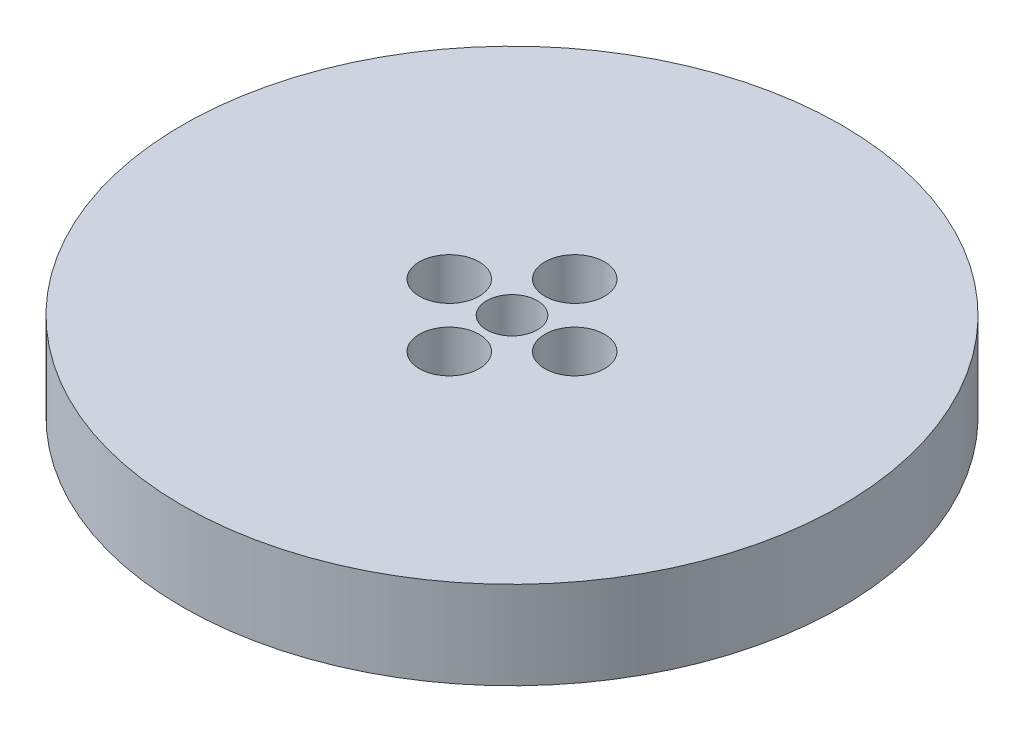
ISO-10303-21;
HEADER;
FILE_DESCRIPTION(('STEP AP214'),'2;1');
FILE_NAME('part.step','',(''),(''),'','','');
FILE_SCHEMA(('AUTOMOTIVE_DESIGN { 1 0 10303 214 1 1 1 1 }'));
ENDSEC;
DATA;
#1=APPLICATION_CONTEXT('core data for automotive mechanical design processes');
#2=APPLICATION_PROTOCOL_DEFINITION('international standard','automotive_design',2000,#1);
#3=PRODUCT_CONTEXT('',#1,'mechanical');
#4=PRODUCT('Part','Part','',(#3));
#5=PRODUCT_RELATED_PRODUCT_CATEGORY('part','',(#4));
#6=PRODUCT_DEFINITION_FORMATION('','',#4);
#7=PRODUCT_DEFINITION_CONTEXT('part definition',#1,'design');
#8=PRODUCT_DEFINITION('design','',#6,#7);
#9=PRODUCT_DEFINITION_SHAPE('','',#8);
#10=(LENGTH_UNIT() NAMED_UNIT(*) SI_UNIT(.MILLI.,.METRE.));
#11=(NAMED_UNIT(*) PLANE_ANGLE_UNIT() SI_UNIT($,.RADIAN.));
#12=(NAMED_UNIT(*) SI_UNIT($,.STERADIAN.) SOLID_ANGLE_UNIT());
#13=UNCERTAINTY_MEASURE_WITH_UNIT(LENGTH_MEASURE(1.E-05),#10,'distance_accuracy_value','');
#14=(GEOMETRIC_REPRESENTATION_CONTEXT(3) GLOBAL_UNCERTAINTY_ASSIGNED_CONTEXT((#13)) GLOBAL_UNIT_ASSIGNED_CONTEXT((#10,
#11,#12)) REPRESENTATION_CONTEXT('',''));
#15=CARTESIAN_POINT('',(0.,0.,0.));
#16=DIRECTION('',(0.,0.,1.));
#17=DIRECTION('',(1.,0.,0.));
#18=AXIS2_PLACEMENT_3D('',#15,#16,#17);
#19=CARTESIAN_POINT('',(0.,26.,0.));
#20=DIRECTION('',(0.,-1.,0.));
#21=DIRECTION('',(0.,0.,-1.));
#22=AXIS2_PLACEMENT_3D('',#19,#20,#21);
#23=CYLINDRICAL_SURFACE('',#22,97.5);
#24=CARTESIAN_POINT('',(0.,26.,0.));
#25=DIRECTION('',(0.,1.,0.));
#26=DIRECTION('',(0.,0.,1.));
#27=AXIS2_PLACEMENT_3D('',#24,#25,#26);
#28=CIRCLE('',#27,97.5);
#29=CARTESIAN_POINT('',(0.,26.,-97.5));
#30=VERTEX_POINT('',#29);
#31=EDGE_CURVE('E10',#30,#30,#28,.T.);
#32=CARTESIAN_POINT('',(0.,0.,0.));
#33=DIRECTION('',(0.,1.,0.));
#34=DIRECTION('',(0.,0.,1.));
#35=AXIS2_PLACEMENT_3D('',#32,#33,#34);
#36=CIRCLE('',#35,97.5);
#37=CARTESIAN_POINT('',(0.,0.,-97.5));
#38=VERTEX_POINT('',#37);
#39=EDGE_CURVE('E37',#38,#38,#36,.T.);
#40=CARTESIAN_POINT('',(0.,26.,-97.5));
#41=CARTESIAN_POINT('',(0.,25.7291666666667,-97.5));
#42=CARTESIAN_POINT('',(0.,25.4583333333333,-97.5));
#43=CARTESIAN_POINT('',(0.,24.9166666666667,-97.5));
#44=CARTESIAN_POINT('',(0.,24.6458333333333,-97.5));
#45=CARTESIAN_POINT('',(0.,24.1041666666667,-97.5));
#46=CARTESIAN_POINT('',(0.,23.8333333333333,-97.5));
#47=CARTESIAN_POINT('',(0.,23.2916666666667,-97.5));
#48=CARTESIAN_POINT('',(0.,23.0208333333333,-97.5));
#49=CARTESIAN_POINT('',(0.,22.4791666666667,-97.5));
#50=CARTESIAN_POINT('',(0.,22.2083333333333,-97.5));
#51=CARTESIAN_POINT('',(0.,21.6666666666667,-97.5));
#52=CARTESIAN_POINT('',(0.,21.3958333333333,-97.5));
#53=CARTESIAN_POINT('',(0.,20.8541666666667,-97.5));
#54=CARTESIAN_POINT('',(0.,20.5833333333333,-97.5));
#55=CARTESIAN_POINT('',(0.,20.0416666666667,-97.5));
#56=CARTESIAN_POINT('',(0.,19.7708333333333,-97.5));
#57=CARTESIAN_POINT('',(0.,19.2291666666667,-97.5));
#58=CARTESIAN_POINT('',(0.,18.9583333333333,-97.5));
#59=CARTESIAN_POINT('',(0.,18.4166666666667,-97.5));
#60=CARTESIAN_POINT('',(0.,18.1458333333333,-97.5));
#61=CARTESIAN_POINT('',(0.,17.6041666666667,-97.5));
#62=CARTESIAN_POINT('',(0.,17.3333333333333,-97.5));
#63=CARTESIAN_POINT('',(0.,16.7916666666667,-97.5));
#64=CARTESIAN_POINT('',(0.,16.5208333333333,-97.5));
#65=CARTESIAN_POINT('',(0.,15.9791666666667,-97.5));
#66=CARTESIAN_POINT('',(0.,15.7083333333333,-97.5));
#67=CARTESIAN_POINT('',(0.,15.1666666666667,-97.5));
#68=CARTESIAN_POINT('',(0.,14.8958333333333,-97.5));
#69=CARTESIAN_POINT('',(0.,14.3541666666667,-97.5));
#70=CARTESIAN_POINT('',(0.,14.0833333333333,-97.5));
#71=CARTESIAN_POINT('',(0.,13.5416666666667,-97.5));
#72=CARTESIAN_POINT('',(0.,13.2708333333333,-97.5));
#73=CARTESIAN_POINT('',(0.,12.7291666666667,-97.5));
#74=CARTESIAN_POINT('',(0.,12.4583333333333,-97.5));
#75=CARTESIAN_POINT('',(0.,11.9166666666667,-97.5));
#76=CARTESIAN_POINT('',(0.,11.6458333333333,-97.5));
#77=CARTESIAN_POINT('',(0.,11.1041666666667,-97.5));
#78=CARTESIAN_POINT('',(0.,10.8333333333333,-97.5));
#79=CARTESIAN_POINT('',(0.,10.2916666666667,-97.5));
#80=CARTESIAN_POINT('',(0.,10.0208333333333,-97.5));
#81=CARTESIAN_POINT('',(0.,9.47916666666667,-97.5));
#82=CARTESIAN_POINT('',(0.,9.20833333333333,-97.5));
#83=CARTESIAN_POINT('',(0.,8.66666666666667,-97.5));
#84=CARTESIAN_POINT('',(0.,8.39583333333333,-97.5));
#85=CARTESIAN_POINT('',(0.,7.85416666666667,-97.5));
#86=CARTESIAN_POINT('',(0.,7.58333333333333,-97.5));
#87=CARTESIAN_POINT('',(0.,7.04166666666667,-97.5));
#88=CARTESIAN_POINT('',(0.,6.77083333333333,-97.5));
#89=CARTESIAN_POINT('',(0.,6.22916666666667,-97.5));
#90=CARTESIAN_POINT('',(0.,5.95833333333333,-97.5));
#91=CARTESIAN_POINT('',(0.,5.41666666666667,-97.5));
#92=CARTESIAN_POINT('',(0.,5.14583333333333,-97.5));
#93=CARTESIAN_POINT('',(0.,4.60416666666667,-97.5));
#94=CARTESIAN_POINT('',(0.,4.33333333333333,-97.5));
#95=CARTESIAN_POINT('',(0.,3.79166666666667,-97.5));
#96=CARTESIAN_POINT('',(0.,3.52083333333333,-97.5));
#97=CARTESIAN_POINT('',(0.,2.97916666666667,-97.5));
#98=CARTESIAN_POINT('',(0.,2.70833333333333,-97.5));
#99=CARTESIAN_POINT('',(0.,2.16666666666667,-97.5));
#100=CARTESIAN_POINT('',(0.,1.89583333333333,-97.5));
#101=CARTESIAN_POINT('',(0.,1.35416666666667,-97.5));
#102=CARTESIAN_POINT('',(0.,1.08333333333333,-97.5));
#103=CARTESIAN_POINT('',(0.,0.541666666666667,-97.5));
#104=CARTESIAN_POINT('',(0.,0.270833333333334,-97.5));
#105=CARTESIAN_POINT('',(0.,0.,-97.5));
#106=B_SPLINE_CURVE_WITH_KNOTS('',3,(#40,#41,#42,#43,#44,#45,#46,#47,#48,#49,#50,#51,#52,#53,
#54,#55,#56,#57,#58,#59,#60,#61,#62,#63,#64,#65,#66,#67,#68,#69,#70,#71,#72,#73,#74,#75,#76,#77,
#78,#79,#80,#81,#82,#83,#84,#85,#86,#87,#88,#89,#90,#91,#92,#93,#94,#95,#96,#97,#98,#99,#100,
#101,#102,#103,#104,#105),.UNSPECIFIED.,.F.,.F.,(4,2,2,2,2,2,2,2,2,2,2,2,2,2,2,2,2,2,2,2,2,2,2,
2,2,2,2,2,2,2,2,2,4),(0.,0.812500000000001,1.625,2.4375,3.25,4.0625,4.875,5.6875,6.5,7.3125,
8.125,8.9375,9.75,10.5625,11.375,12.1875,13.,13.8125,14.625,15.4375,16.25,17.0625,17.875,
18.6875,19.5,20.3125,21.125,21.9375,22.75,23.5625,24.375,25.1875,26.),.UNSPECIFIED.);
#107=EDGE_CURVE('BSEAM40',#30,#38,#106,.T.);
#108=ORIENTED_EDGE('',*,*,#31,.F.);
#109=ORIENTED_EDGE('',*,*,#39,.T.);
#110=ORIENTED_EDGE('',*,*,#107,.T.);
#111=ORIENTED_EDGE('',*,*,#107,.F.);
#112=EDGE_LOOP('',(#108,#110,#109,#111));
#113=FACE_BOUND('',#112,.T.);
#114=ADVANCED_FACE('F40',(#113),#23,.T.);
#115=CARTESIAN_POINT('',(0.,26.,0.));
#116=DIRECTION('',(0.,1.,0.));
#117=DIRECTION('',(0.,0.,1.));
#118=AXIS2_PLACEMENT_3D('',#115,#116,#117);
#119=PLANE('',#118);
#120=CARTESIAN_POINT('',(0.,26.,18.5635144702194));
#121=DIRECTION('',(0.,1.,0.));
#122=DIRECTION('',(1.,0.,0.));
#123=AXIS2_PLACEMENT_3D('',#120,#121,#122);
#124=CIRCLE('',#123,8.83991167098881);
#125=CARTESIAN_POINT('',(8.83991167098888,26.,18.5635144702193));
#126=VERTEX_POINT('',#125);
#127=EDGE_CURVE('E71',#126,#126,#124,.T.);
#128=ORIENTED_EDGE('',*,*,#127,.F.);
#129=EDGE_LOOP('',(#128));
#130=FACE_BOUND('',#129,.T.);
#131=CARTESIAN_POINT('',(18.5635144702194,26.,0.));
#132=DIRECTION('',(0.,1.,0.));
#133=DIRECTION('',(0.,0.,-1.));
#134=AXIS2_PLACEMENT_3D('',#131,#132,#133);
#135=CIRCLE('',#134,8.83991167098881);
#136=CARTESIAN_POINT('',(18.5635144702194,26.,-8.83991167098881));
#137=VERTEX_POINT('',#136);
#138=EDGE_CURVE('E70',#137,#137,#135,.T.);
#139=ORIENTED_EDGE('',*,*,#138,.F.);
#140=EDGE_LOOP('',(#139));
#141=FACE_BOUND('',#140,.T.);
#142=CARTESIAN_POINT('',(-1.94442493068346E-13,26.,-18.5635144702194));
#143=DIRECTION('',(0.,1.,0.));
#144=DIRECTION('',(-1.,0.,0.));
#145=AXIS2_PLACEMENT_3D('',#142,#143,#144);
#146=CIRCLE('',#145,8.83991167098881);
#147=CARTESIAN_POINT('',(-8.83991167098901,26.,-18.5635144702193));
#148=VERTEX_POINT('',#147);
#149=EDGE_CURVE('E61',#148,#148,#146,.T.);
#150=ORIENTED_EDGE('',*,*,#149,.F.);
#151=EDGE_LOOP('',(#150));
#152=FACE_BOUND('',#151,.T.);
#153=CARTESIAN_POINT('',(-18.5635144702194,26.,0.));
#154=DIRECTION('',(0.,1.,0.));
#155=DIRECTION('',(0.,0.,1.));
#156=AXIS2_PLACEMENT_3D('',#153,#154,#155);
#157=CIRCLE('',#156,8.83991167098881);
#158=CARTESIAN_POINT('',(-18.5635144702194,26.,8.83991167098881));
#159=VERTEX_POINT('',#158);
#160=EDGE_CURVE('E54',#159,#159,#157,.T.);
#161=ORIENTED_EDGE('',*,*,#160,.F.);
#162=EDGE_LOOP('',(#161));
#163=FACE_BOUND('',#162,.T.);
#164=CARTESIAN_POINT('',(0.,26.,0.));
#165=DIRECTION('',(0.,1.,0.));
#166=DIRECTION('',(0.,0.,1.));
#167=AXIS2_PLACEMENT_3D('',#164,#165,#166);
#168=CIRCLE('',#167,7.5);
#169=CARTESIAN_POINT('',(0.,26.,-7.5));
#170=VERTEX_POINT('',#169);
#171=EDGE_CURVE('E50',#170,#170,#168,.T.);
#172=ORIENTED_EDGE('',*,*,#171,.F.);
#173=EDGE_LOOP('',(#172));
#174=FACE_BOUND('',#173,.T.);
#175=ORIENTED_EDGE('',*,*,#31,.T.);
#176=EDGE_LOOP('',(#175));
#177=FACE_BOUND('',#176,.T.);
#178=ADVANCED_FACE('F86',(#130,#141,#152,#163,#174,#177),#119,.T.);
#179=CARTESIAN_POINT('',(0.,0.,0.));
#180=DIRECTION('',(0.,1.,0.));
#181=DIRECTION('',(0.,0.,1.));
#182=AXIS2_PLACEMENT_3D('',#179,#180,#181);
#183=PLANE('',#182);
#184=CARTESIAN_POINT('',(0.,0.,0.));
#185=DIRECTION('',(0.,1.,0.));
#186=DIRECTION('',(0.,0.,1.));
#187=AXIS2_PLACEMENT_3D('',#184,#185,#186);
#188=CIRCLE('',#187,7.5);
#189=CARTESIAN_POINT('',(0.,0.,-7.5));
#190=VERTEX_POINT('',#189);
#191=EDGE_CURVE('E47',#190,#190,#188,.T.);
#192=ORIENTED_EDGE('',*,*,#191,.T.);
#193=EDGE_LOOP('',(#192));
#194=FACE_BOUND('',#193,.T.);
#195=ORIENTED_EDGE('',*,*,#39,.F.);
#196=EDGE_LOOP('',(#195));
#197=FACE_BOUND('',#196,.T.);
#198=ADVANCED_FACE('F93',(#194,#197),#183,.F.);
#199=CARTESIAN_POINT('',(0.,26.,0.));
#200=DIRECTION('',(0.,-1.,0.));
#201=DIRECTION('',(0.,0.,-1.));
#202=AXIS2_PLACEMENT_3D('',#199,#200,#201);
#203=CYLINDRICAL_SURFACE('',#202,7.5);
#204=CARTESIAN_POINT('',(0.,26.,-7.5));
#205=CARTESIAN_POINT('',(0.,25.7291666666667,-7.5));
#206=CARTESIAN_POINT('',(0.,25.4583333333333,-7.5));
#207=CARTESIAN_POINT('',(0.,24.9166666666667,-7.5));
#208=CARTESIAN_POINT('',(0.,24.6458333333333,-7.5));
#209=CARTESIAN_POINT('',(0.,24.1041666666667,-7.5));
#210=CARTESIAN_POINT('',(0.,23.8333333333333,-7.5));
#211=CARTESIAN_POINT('',(0.,23.2916666666667,-7.5));
#212=CARTESIAN_POINT('',(0.,23.0208333333333,-7.5));
#213=CARTESIAN_POINT('',(0.,22.4791666666667,-7.5));
#214=CARTESIAN_POINT('',(0.,22.2083333333333,-7.5));
#215=CARTESIAN_POINT('',(0.,21.6666666666667,-7.5));
#216=CARTESIAN_POINT('',(0.,21.3958333333333,-7.5));
#217=CARTESIAN_POINT('',(0.,20.8541666666667,-7.5));
#218=CARTESIAN_POINT('',(0.,20.5833333333333,-7.5));
#219=CARTESIAN_POINT('',(0.,20.0416666666667,-7.5));
#220=CARTESIAN_POINT('',(0.,19.7708333333333,-7.5));
#221=CARTESIAN_POINT('',(0.,19.2291666666667,-7.5));
#222=CARTESIAN_POINT('',(0.,18.9583333333333,-7.5));
#223=CARTESIAN_POINT('',(0.,18.4166666666667,-7.5));
#224=CARTESIAN_POINT('',(0.,18.1458333333333,-7.5));
#225=CARTESIAN_POINT('',(0.,17.6041666666667,-7.5));
#226=CARTESIAN_POINT('',(0.,17.3333333333333,-7.5));
#227=CARTESIAN_POINT('',(0.,16.7916666666667,-7.5));
#228=CARTESIAN_POINT('',(0.,16.5208333333333,-7.5));
#229=CARTESIAN_POINT('',(0.,15.9791666666667,-7.5));
#230=CARTESIAN_POINT('',(0.,15.7083333333333,-7.5));
#231=CARTESIAN_POINT('',(0.,15.1666666666667,-7.5));
#232=CARTESIAN_POINT('',(0.,14.8958333333333,-7.5));
#233=CARTESIAN_POINT('',(0.,14.3541666666667,-7.5));
#234=CARTESIAN_POINT('',(0.,14.0833333333333,-7.5));
#235=CARTESIAN_POINT('',(0.,13.5416666666667,-7.5));
#236=CARTESIAN_POINT('',(0.,13.2708333333333,-7.5));
#237=CARTESIAN_POINT('',(0.,12.7291666666667,-7.5));
#238=CARTESIAN_POINT('',(0.,12.4583333333333,-7.5));
#239=CARTESIAN_POINT('',(0.,11.9166666666667,-7.5));
#240=CARTESIAN_POINT('',(0.,11.6458333333333,-7.5));
#241=CARTESIAN_POINT('',(0.,11.1041666666667,-7.5));
#242=CARTESIAN_POINT('',(0.,10.8333333333333,-7.5));
#243=CARTESIAN_POINT('',(0.,10.2916666666667,-7.5));
#244=CARTESIAN_POINT('',(0.,10.0208333333333,-7.5));
#245=CARTESIAN_POINT('',(0.,9.47916666666667,-7.5));
#246=CARTESIAN_POINT('',(0.,9.20833333333333,-7.5));
#247=CARTESIAN_POINT('',(0.,8.66666666666667,-7.5));
#248=CARTESIAN_POINT('',(0.,8.39583333333333,-7.5));
#249=CARTESIAN_POINT('',(0.,7.85416666666667,-7.5));
#250=CARTESIAN_POINT('',(0.,7.58333333333333,-7.5));
#251=CARTESIAN_POINT('',(0.,7.04166666666667,-7.5));
#252=CARTESIAN_POINT('',(0.,6.77083333333333,-7.5));
#253=CARTESIAN_POINT('',(0.,6.22916666666667,-7.5));
#254=CARTESIAN_POINT('',(0.,5.95833333333333,-7.5));
#255=CARTESIAN_POINT('',(0.,5.41666666666667,-7.5));
#256=CARTESIAN_POINT('',(0.,5.14583333333333,-7.5));
#257=CARTESIAN_POINT('',(0.,4.60416666666667,-7.5));
#258=CARTESIAN_POINT('',(0.,4.33333333333333,-7.5));
#259=CARTESIAN_POINT('',(0.,3.79166666666667,-7.5));
#260=CARTESIAN_POINT('',(0.,3.52083333333333,-7.5));
#261=CARTESIAN_POINT('',(0.,2.97916666666667,-7.5));
#262=CARTESIAN_POINT('',(0.,2.70833333333333,-7.5));
#263=CARTESIAN_POINT('',(0.,2.16666666666667,-7.5));
#264=CARTESIAN_POINT('',(0.,1.89583333333333,-7.5));
#265=CARTESIAN_POINT('',(0.,1.35416666666667,-7.5));
#266=CARTESIAN_POINT('',(0.,1.08333333333333,-7.5));
#267=CARTESIAN_POINT('',(0.,0.541666666666667,-7.5));
#268=CARTESIAN_POINT('',(0.,0.270833333333334,-7.5));
#269=CARTESIAN_POINT('',(0.,0.,-7.5));
#270=B_SPLINE_CURVE_WITH_KNOTS('',3,(#204,#205,#206,#207,#208,#209,#210,#211,#212,#213,#214,
#215,#216,#217,#218,#219,#220,#221,#222,#223,#224,#225,#226,#227,#228,#229,#230,#231,#232,#233,
#234,#235,#236,#237,#238,#239,#240,#241,#242,#243,#244,#245,#246,#247,#248,#249,#250,#251,#252,
#253,#254,#255,#256,#257,#258,#259,#260,#261,#262,#263,#264,#265,#266,#267,#268,#269),
.UNSPECIFIED.,.F.,.F.,(4,2,2,2,2,2,2,2,2,2,2,2,2,2,2,2,2,2,2,2,2,2,2,2,2,2,2,2,2,2,2,2,4),(0.,
0.812499999999997,1.625,2.4375,3.25,4.0625,4.875,5.6875,6.5,7.3125,8.125,8.93749999999999,
9.74999999999999,10.5625,11.375,12.1875,13.,13.8125,14.625,15.4375,16.25,17.0625,17.875,18.6875,
19.5,20.3125,21.125,21.9375,22.75,23.5625,24.375,25.1875,26.),.UNSPECIFIED.);
#271=EDGE_CURVE('BSEAM101',#170,#190,#270,.T.);
#272=ORIENTED_EDGE('',*,*,#171,.T.);
#273=ORIENTED_EDGE('',*,*,#191,.F.);
#274=ORIENTED_EDGE('',*,*,#271,.T.);
#275=ORIENTED_EDGE('',*,*,#271,.F.);
#276=EDGE_LOOP('',(#272,#274,#273,#275));
#277=FACE_BOUND('',#276,.T.);
#278=ADVANCED_FACE('F101',(#277),#203,.F.);
#279=CARTESIAN_POINT('',(-18.5635144702194,2.9755994858409,0.));
#280=DIRECTION('',(0.,1.,0.));
#281=DIRECTION('',(0.,0.,1.));
#282=AXIS2_PLACEMENT_3D('',#279,#280,#281);
#283=CYLINDRICAL_SURFACE('',#282,8.83991167098881);
#284=CARTESIAN_POINT('',(-18.5635144702194,2.9755994858409,0.));
#285=DIRECTION('',(0.,1.,0.));
#286=DIRECTION('',(0.,0.,1.));
#287=AXIS2_PLACEMENT_3D('',#284,#285,#286);
#288=CIRCLE('',#287,8.83991167098881);
#289=CARTESIAN_POINT('',(-18.5635144702194,2.9755994858409,8.83991167098881));
#290=VERTEX_POINT('',#289);
#291=EDGE_CURVE('E55',#290,#290,#288,.T.);
#292=ORIENTED_EDGE('',*,*,#291,.F.);
#293=EDGE_LOOP('',(#292));
#294=FACE_BOUND('',#293,.T.);
#295=ORIENTED_EDGE('',*,*,#160,.T.);
#296=EDGE_LOOP('',(#295));
#297=FACE_BOUND('',#296,.T.);
#298=ADVANCED_FACE('F102',(#294,#297),#283,.F.);
#299=CARTESIAN_POINT('',(-18.5635144702194,2.9755994858409,0.));
#300=DIRECTION('',(0.,1.,0.));
#301=DIRECTION('',(0.,0.,1.));
#302=AXIS2_PLACEMENT_3D('',#299,#300,#301);
#303=PLANE('',#302);
#304=ORIENTED_EDGE('',*,*,#291,.T.);
#305=EDGE_LOOP('',(#304));
#306=FACE_BOUND('',#305,.T.);
#307=ADVANCED_FACE('F133',(#306),#303,.T.);
#308=CARTESIAN_POINT('',(-1.94442493068346E-13,2.9755994858409,-18.5635144702194));
#309=DIRECTION('',(0.,1.,0.));
#310=DIRECTION('',(0.,0.,1.));
#311=AXIS2_PLACEMENT_3D('',#308,#309,#310);
#312=CYLINDRICAL_SURFACE('',#311,8.83991167098881);
#313=CARTESIAN_POINT('',(-1.94442493068346E-13,2.9755994858409,-18.5635144702194));
#314=DIRECTION('',(0.,1.,0.));
#315=DIRECTION('',(-1.,0.,0.));
#316=AXIS2_PLACEMENT_3D('',#313,#314,#315);
#317=CIRCLE('',#316,8.83991167098881);
#318=CARTESIAN_POINT('',(-8.83991167098901,2.9755994858409,-18.5635144702193));
#319=VERTEX_POINT('',#318);
#320=EDGE_CURVE('E63',#319,#319,#317,.T.);
#321=ORIENTED_EDGE('',*,*,#320,.F.);
#322=EDGE_LOOP('',(#321));
#323=FACE_BOUND('',#322,.T.);
#324=ORIENTED_EDGE('',*,*,#149,.T.);
#325=EDGE_LOOP('',(#324));
#326=FACE_BOUND('',#325,.T.);
#327=ADVANCED_FACE('F142',(#323,#326),#312,.F.);
#328=CARTESIAN_POINT('',(-1.94442493068346E-13,2.9755994858409,-18.5635144702194));
#329=DIRECTION('',(0.,1.,0.));
#330=DIRECTION('',(-1.,0.,0.));
#331=AXIS2_PLACEMENT_3D('',#328,#329,#330);
#332=PLANE('',#331);
#333=ORIENTED_EDGE('',*,*,#320,.T.);
#334=EDGE_LOOP('',(#333));
#335=FACE_BOUND('',#334,.T.);
#336=ADVANCED_FACE('F156',(#335),#332,.T.);
#337=CARTESIAN_POINT('',(18.5635144702194,2.9755994858409,0.));
#338=DIRECTION('',(0.,1.,0.));
#339=DIRECTION('',(0.,0.,1.));
#340=AXIS2_PLACEMENT_3D('',#337,#338,#339);
#341=CYLINDRICAL_SURFACE('',#340,8.83991167098881);
#342=CARTESIAN_POINT('',(18.5635144702194,2.9755994858409,0.));
#343=DIRECTION('',(0.,1.,0.));
#344=DIRECTION('',(0.,0.,-1.));
#345=AXIS2_PLACEMENT_3D('',#342,#343,#344);
#346=CIRCLE('',#345,8.83991167098881);
#347=CARTESIAN_POINT('',(18.5635144702194,2.9755994858409,-8.83991167098881));
#348=VERTEX_POINT('',#347);
#349=EDGE_CURVE('E69',#348,#348,#346,.T.);
#350=ORIENTED_EDGE('',*,*,#349,.F.);
#351=EDGE_LOOP('',(#350));
#352=FACE_BOUND('',#351,.T.);
#353=ORIENTED_EDGE('',*,*,#138,.T.);
#354=EDGE_LOOP('',(#353));
#355=FACE_BOUND('',#354,.T.);
#356=ADVANCED_FACE('F164',(#352,#355),#341,.F.);
#357=CARTESIAN_POINT('',(18.5635144702194,2.9755994858409,0.));
#358=DIRECTION('',(0.,1.,0.));
#359=DIRECTION('',(0.,0.,-1.));
#360=AXIS2_PLACEMENT_3D('',#357,#358,#359);
#361=PLANE('',#360);
#362=ORIENTED_EDGE('',*,*,#349,.T.);
#363=EDGE_LOOP('',(#362));
#364=FACE_BOUND('',#363,.T.);
#365=ADVANCED_FACE('F83',(#364),#361,.T.);
#366=CARTESIAN_POINT('',(0.,2.9755994858409,18.5635144702194));
#367=DIRECTION('',(0.,1.,0.));
#368=DIRECTION('',(0.,0.,1.));
#369=AXIS2_PLACEMENT_3D('',#366,#367,#368);
#370=CYLINDRICAL_SURFACE('',#369,8.83991167098881);
#371=CARTESIAN_POINT('',(0.,2.9755994858409,18.5635144702194));
#372=DIRECTION('',(0.,1.,0.));
#373=DIRECTION('',(1.,0.,0.));
#374=AXIS2_PLACEMENT_3D('',#371,#372,#373);
#375=CIRCLE('',#374,8.83991167098881);
#376=CARTESIAN_POINT('',(8.83991167098888,2.9755994858409,18.5635144702193));
#377=VERTEX_POINT('',#376);
#378=EDGE_CURVE('E59',#377,#377,#375,.T.);
#379=ORIENTED_EDGE('',*,*,#378,.F.);
#380=EDGE_LOOP('',(#379));
#381=FACE_BOUND('',#380,.T.);
#382=ORIENTED_EDGE('',*,*,#127,.T.);
#383=EDGE_LOOP('',(#382));
#384=FACE_BOUND('',#383,.T.);
#385=ADVANCED_FACE('F81',(#381,#384),#370,.F.);
#386=CARTESIAN_POINT('',(0.,2.9755994858409,18.5635144702194));
#387=DIRECTION('',(0.,1.,0.));
#388=DIRECTION('',(1.,0.,0.));
#389=AXIS2_PLACEMENT_3D('',#386,#387,#388);
#390=PLANE('',#389);
#391=ORIENTED_EDGE('',*,*,#378,.T.);
#392=EDGE_LOOP('',(#391));
#393=FACE_BOUND('',#392,.T.);
#394=ADVANCED_FACE('F78',(#393),#390,.T.);
#395=CLOSED_SHELL('',(#114,#178,#198,#278,#298,#307,#327,#336,#356,#365,#385,#394));
#396=MANIFOLD_SOLID_BREP('B2',#395);
#397=ADVANCED_BREP_SHAPE_REPRESENTATION('',(#18,#396),#14);
#398=SHAPE_DEFINITION_REPRESENTATION(#9,#397);
ENDSEC;
END-ISO-10303-21;
